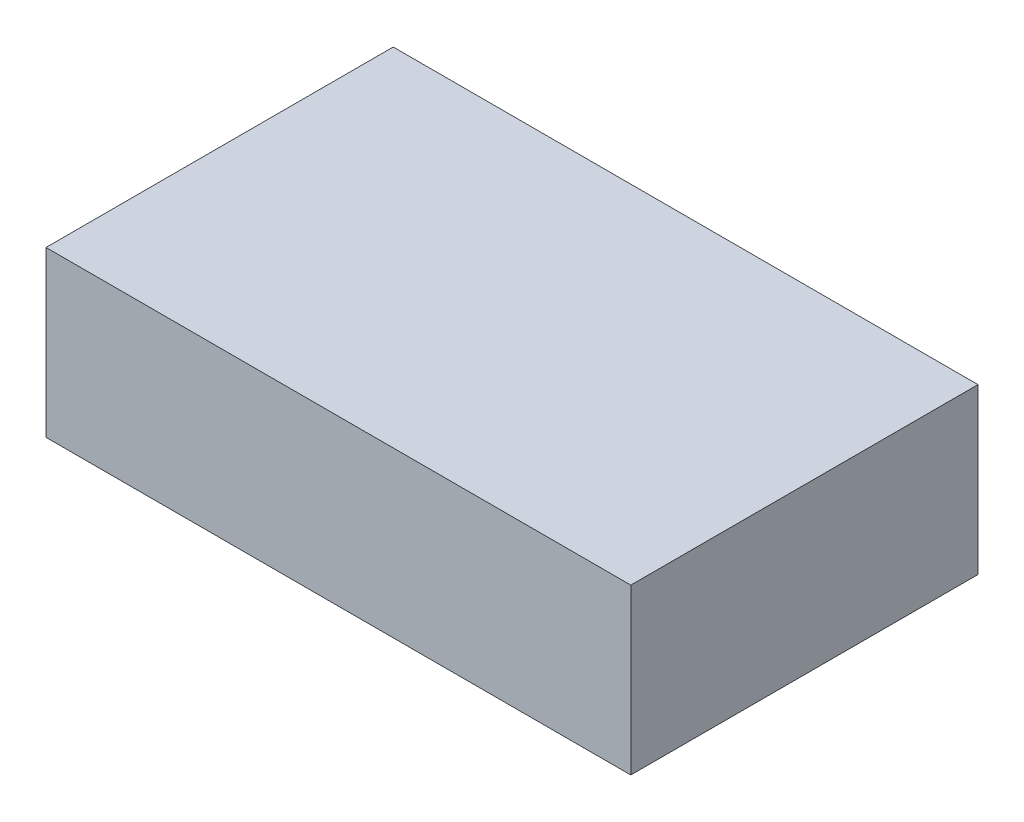
ISO-10303-21;
HEADER;
FILE_DESCRIPTION(('STEP AP214'),'2;1');
FILE_NAME('part.step','',(''),(''),'','','');
FILE_SCHEMA(('AUTOMOTIVE_DESIGN { 1 0 10303 214 1 1 1 1 }'));
ENDSEC;
DATA;
#1=APPLICATION_CONTEXT('core data for automotive mechanical design processes');
#2=APPLICATION_PROTOCOL_DEFINITION('international standard','automotive_design',2000,#1);
#3=PRODUCT_CONTEXT('',#1,'mechanical');
#4=PRODUCT('Part','Part','',(#3));
#5=PRODUCT_RELATED_PRODUCT_CATEGORY('part','',(#4));
#6=PRODUCT_DEFINITION_FORMATION('','',#4);
#7=PRODUCT_DEFINITION_CONTEXT('part definition',#1,'design');
#8=PRODUCT_DEFINITION('design','',#6,#7);
#9=PRODUCT_DEFINITION_SHAPE('','',#8);
#10=(LENGTH_UNIT() NAMED_UNIT(*) SI_UNIT(.MILLI.,.METRE.));
#11=(NAMED_UNIT(*) PLANE_ANGLE_UNIT() SI_UNIT($,.RADIAN.));
#12=(NAMED_UNIT(*) SI_UNIT($,.STERADIAN.) SOLID_ANGLE_UNIT());
#13=UNCERTAINTY_MEASURE_WITH_UNIT(LENGTH_MEASURE(1.E-05),#10,'distance_accuracy_value','');
#14=(GEOMETRIC_REPRESENTATION_CONTEXT(3) GLOBAL_UNCERTAINTY_ASSIGNED_CONTEXT((#13)) GLOBAL_UNIT_ASSIGNED_CONTEXT((#10,
#11,#12)) REPRESENTATION_CONTEXT('',''));
#15=CARTESIAN_POINT('',(0.,0.,0.));
#16=DIRECTION('',(0.,0.,1.));
#17=DIRECTION('',(1.,0.,0.));
#18=AXIS2_PLACEMENT_3D('',#15,#16,#17);
#19=CARTESIAN_POINT('',(16.,9.,9.5));
#20=DIRECTION('',(-1.,0.,0.));
#21=DIRECTION('',(0.,0.,1.));
#22=AXIS2_PLACEMENT_3D('',#19,#20,#21);
#23=PLANE('',#22);
#24=DIRECTION('',(0.,0.,-1.));
#25=VECTOR('',#24,1.);
#26=CARTESIAN_POINT('',(16.,0.,9.5));
#27=LINE('',#26,#25);
#28=CARTESIAN_POINT('',(16.,0.,9.5));
#29=VERTEX_POINT('',#28);
#30=CARTESIAN_POINT('',(16.,0.,-9.5));
#31=VERTEX_POINT('',#30);
#32=EDGE_CURVE('E111',#29,#31,#27,.T.);
#33=ORIENTED_EDGE('',*,*,#32,.T.);
#34=DIRECTION('',(0.,-1.,0.));
#35=VECTOR('',#34,1.);
#36=CARTESIAN_POINT('',(16.,9.,-9.5));
#37=LINE('',#36,#35);
#38=CARTESIAN_POINT('',(16.,9.,-9.5));
#39=VERTEX_POINT('',#38);
#40=EDGE_CURVE('E11',#39,#31,#37,.T.);
#41=ORIENTED_EDGE('',*,*,#40,.F.);
#42=DIRECTION('',(0.,0.,-1.));
#43=VECTOR('',#42,1.);
#44=CARTESIAN_POINT('',(16.,9.,9.5));
#45=LINE('',#44,#43);
#46=CARTESIAN_POINT('',(16.,9.,9.5));
#47=VERTEX_POINT('',#46);
#48=EDGE_CURVE('E95',#47,#39,#45,.T.);
#49=ORIENTED_EDGE('',*,*,#48,.F.);
#50=DIRECTION('',(0.,-1.,0.));
#51=VECTOR('',#50,1.);
#52=CARTESIAN_POINT('',(16.,9.,9.5));
#53=LINE('',#52,#51);
#54=EDGE_CURVE('E107',#47,#29,#53,.T.);
#55=ORIENTED_EDGE('',*,*,#54,.T.);
#56=EDGE_LOOP('',(#33,#41,#49,#55));
#57=FACE_BOUND('',#56,.T.);
#58=ADVANCED_FACE('F43',(#57),#23,.F.);
#59=CARTESIAN_POINT('',(-16.,9.,-9.5));
#60=DIRECTION('',(0.,0.,1.));
#61=DIRECTION('',(1.,0.,0.));
#62=AXIS2_PLACEMENT_3D('',#59,#60,#61);
#63=PLANE('',#62);
#64=DIRECTION('',(-1.,0.,0.));
#65=VECTOR('',#64,1.);
#66=CARTESIAN_POINT('',(-16.,0.,-9.5));
#67=LINE('',#66,#65);
#68=CARTESIAN_POINT('',(-16.,0.,-9.5));
#69=VERTEX_POINT('',#68);
#70=EDGE_CURVE('E100',#31,#69,#67,.T.);
#71=ORIENTED_EDGE('',*,*,#70,.T.);
#72=DIRECTION('',(0.,-1.,0.));
#73=VECTOR('',#72,1.);
#74=CARTESIAN_POINT('',(-16.,9.,-9.5));
#75=LINE('',#74,#73);
#76=CARTESIAN_POINT('',(-16.,9.,-9.5));
#77=VERTEX_POINT('',#76);
#78=EDGE_CURVE('E52',#77,#69,#75,.T.);
#79=ORIENTED_EDGE('',*,*,#78,.F.);
#80=DIRECTION('',(-1.,0.,0.));
#81=VECTOR('',#80,1.);
#82=CARTESIAN_POINT('',(-16.,9.,-9.5));
#83=LINE('',#82,#81);
#84=EDGE_CURVE('E90',#39,#77,#83,.T.);
#85=ORIENTED_EDGE('',*,*,#84,.F.);
#86=ORIENTED_EDGE('',*,*,#40,.T.);
#87=EDGE_LOOP('',(#71,#79,#85,#86));
#88=FACE_BOUND('',#87,.T.);
#89=ADVANCED_FACE('F99',(#88),#63,.F.);
#90=CARTESIAN_POINT('',(-16.,9.,9.5));
#91=DIRECTION('',(1.,0.,0.));
#92=DIRECTION('',(0.,0.,-1.));
#93=AXIS2_PLACEMENT_3D('',#90,#91,#92);
#94=PLANE('',#93);
#95=DIRECTION('',(0.,0.,1.));
#96=VECTOR('',#95,1.);
#97=CARTESIAN_POINT('',(-16.,0.,9.5));
#98=LINE('',#97,#96);
#99=CARTESIAN_POINT('',(-16.,0.,9.5));
#100=VERTEX_POINT('',#99);
#101=EDGE_CURVE('E77',#69,#100,#98,.T.);
#102=ORIENTED_EDGE('',*,*,#101,.T.);
#103=DIRECTION('',(0.,-1.,0.));
#104=VECTOR('',#103,1.);
#105=CARTESIAN_POINT('',(-16.,9.,9.5));
#106=LINE('',#105,#104);
#107=CARTESIAN_POINT('',(-16.,9.,9.5));
#108=VERTEX_POINT('',#107);
#109=EDGE_CURVE('E102',#108,#100,#106,.T.);
#110=ORIENTED_EDGE('',*,*,#109,.F.);
#111=DIRECTION('',(0.,0.,1.));
#112=VECTOR('',#111,1.);
#113=CARTESIAN_POINT('',(-16.,9.,9.5));
#114=LINE('',#113,#112);
#115=EDGE_CURVE('E93',#77,#108,#114,.T.);
#116=ORIENTED_EDGE('',*,*,#115,.F.);
#117=ORIENTED_EDGE('',*,*,#78,.T.);
#118=EDGE_LOOP('',(#102,#110,#116,#117));
#119=FACE_BOUND('',#118,.T.);
#120=ADVANCED_FACE('F103',(#119),#94,.F.);
#121=CARTESIAN_POINT('',(-16.,9.,9.5));
#122=DIRECTION('',(0.,0.,-1.));
#123=DIRECTION('',(-1.,0.,0.));
#124=AXIS2_PLACEMENT_3D('',#121,#122,#123);
#125=PLANE('',#124);
#126=DIRECTION('',(1.,0.,0.));
#127=VECTOR('',#126,1.);
#128=CARTESIAN_POINT('',(-16.,0.,9.5));
#129=LINE('',#128,#127);
#130=EDGE_CURVE('E83',#100,#29,#129,.T.);
#131=ORIENTED_EDGE('',*,*,#130,.T.);
#132=ORIENTED_EDGE('',*,*,#54,.F.);
#133=DIRECTION('',(1.,0.,0.));
#134=VECTOR('',#133,1.);
#135=CARTESIAN_POINT('',(-16.,9.,9.5));
#136=LINE('',#135,#134);
#137=EDGE_CURVE('E60',#108,#47,#136,.T.);
#138=ORIENTED_EDGE('',*,*,#137,.F.);
#139=ORIENTED_EDGE('',*,*,#109,.T.);
#140=EDGE_LOOP('',(#131,#132,#138,#139));
#141=FACE_BOUND('',#140,.T.);
#142=ADVANCED_FACE('F124',(#141),#125,.F.);
#143=CARTESIAN_POINT('',(0.,9.,0.));
#144=DIRECTION('',(0.,-1.,0.));
#145=DIRECTION('',(0.,0.,-1.));
#146=AXIS2_PLACEMENT_3D('',#143,#144,#145);
#147=PLANE('',#146);
#148=ORIENTED_EDGE('',*,*,#48,.T.);
#149=ORIENTED_EDGE('',*,*,#84,.T.);
#150=ORIENTED_EDGE('',*,*,#115,.T.);
#151=ORIENTED_EDGE('',*,*,#137,.T.);
#152=EDGE_LOOP('',(#148,#149,#150,#151));
#153=FACE_BOUND('',#152,.T.);
#154=ADVANCED_FACE('F91',(#153),#147,.F.);
#155=CARTESIAN_POINT('',(0.,0.,0.));
#156=DIRECTION('',(0.,-1.,0.));
#157=DIRECTION('',(0.,0.,-1.));
#158=AXIS2_PLACEMENT_3D('',#155,#156,#157);
#159=PLANE('',#158);
#160=ORIENTED_EDGE('',*,*,#32,.F.);
#161=ORIENTED_EDGE('',*,*,#130,.F.);
#162=ORIENTED_EDGE('',*,*,#101,.F.);
#163=ORIENTED_EDGE('',*,*,#70,.F.);
#164=EDGE_LOOP('',(#160,#161,#162,#163));
#165=FACE_BOUND('',#164,.T.);
#166=ADVANCED_FACE('F127',(#165),#159,.T.);
#167=CLOSED_SHELL('',(#58,#89,#120,#142,#154,#166));
#168=MANIFOLD_SOLID_BREP('B2',#167);
#169=ADVANCED_BREP_SHAPE_REPRESENTATION('',(#18,#168),#14);
#170=SHAPE_DEFINITION_REPRESENTATION(#9,#169);
ENDSEC;
END-ISO-10303-21;
